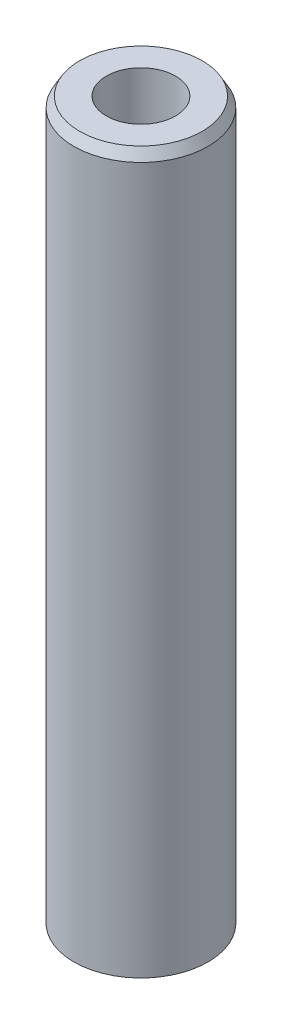
ISO-10303-21;
HEADER;
FILE_DESCRIPTION(('STEP AP214'),'2;1');
FILE_NAME('part.step','',(''),(''),'','','');
FILE_SCHEMA(('AUTOMOTIVE_DESIGN { 1 0 10303 214 1 1 1 1 }'));
ENDSEC;
DATA;
#1=APPLICATION_CONTEXT('core data for automotive mechanical design processes');
#2=APPLICATION_PROTOCOL_DEFINITION('international standard','automotive_design',2000,#1);
#3=PRODUCT_CONTEXT('',#1,'mechanical');
#4=PRODUCT('Part','Part','',(#3));
#5=PRODUCT_RELATED_PRODUCT_CATEGORY('part','',(#4));
#6=PRODUCT_DEFINITION_FORMATION('','',#4);
#7=PRODUCT_DEFINITION_CONTEXT('part definition',#1,'design');
#8=PRODUCT_DEFINITION('design','',#6,#7);
#9=PRODUCT_DEFINITION_SHAPE('','',#8);
#10=(LENGTH_UNIT() NAMED_UNIT(*) SI_UNIT(.MILLI.,.METRE.));
#11=(NAMED_UNIT(*) PLANE_ANGLE_UNIT() SI_UNIT($,.RADIAN.));
#12=(NAMED_UNIT(*) SI_UNIT($,.STERADIAN.) SOLID_ANGLE_UNIT());
#13=UNCERTAINTY_MEASURE_WITH_UNIT(LENGTH_MEASURE(1.E-05),#10,'distance_accuracy_value','');
#14=(GEOMETRIC_REPRESENTATION_CONTEXT(3) GLOBAL_UNCERTAINTY_ASSIGNED_CONTEXT((#13)) GLOBAL_UNIT_ASSIGNED_CONTEXT((#10,
#11,#12)) REPRESENTATION_CONTEXT('',''));
#15=CARTESIAN_POINT('',(0.,0.,0.));
#16=DIRECTION('',(0.,0.,1.));
#17=DIRECTION('',(1.,0.,0.));
#18=AXIS2_PLACEMENT_3D('',#15,#16,#17);
#19=CARTESIAN_POINT('',(0.,188.355232041194,0.));
#20=DIRECTION('',(0.,-1.,0.));
#21=DIRECTION('',(0.,0.,-1.));
#22=AXIS2_PLACEMENT_3D('',#19,#20,#21);
#23=CYLINDRICAL_SURFACE('',#22,17.5);
#24=CARTESIAN_POINT('',(0.,185.717655159102,0.));
#25=DIRECTION('',(0.,1.,0.));
#26=DIRECTION('',(0.,0.,1.));
#27=AXIS2_PLACEMENT_3D('',#24,#25,#26);
#28=CIRCLE('',#27,17.5);
#29=CARTESIAN_POINT('',(0.,185.717655159102,17.5));
#30=VERTEX_POINT('',#29);
#31=EDGE_CURVE('E50',#30,#30,#28,.F.);
#32=ORIENTED_EDGE('',*,*,#31,.T.);
#33=EDGE_LOOP('',(#32));
#34=FACE_BOUND('',#33,.T.);
#35=CARTESIAN_POINT('',(0.,1.52280572288413,0.));
#36=DIRECTION('',(0.,1.,0.));
#37=DIRECTION('',(0.,0.,1.));
#38=AXIS2_PLACEMENT_3D('',#35,#36,#37);
#39=CIRCLE('',#38,17.5);
#40=CARTESIAN_POINT('',(0.,1.52280572288413,17.5));
#41=VERTEX_POINT('',#40);
#42=EDGE_CURVE('E51',#41,#41,#39,.T.);
#43=ORIENTED_EDGE('',*,*,#42,.T.);
#44=EDGE_LOOP('',(#43));
#45=FACE_BOUND('',#44,.T.);
#46=ADVANCED_FACE('F39',(#34,#45),#23,.T.);
#47=CARTESIAN_POINT('',(0.,188.355232041194,0.));
#48=DIRECTION('',(0.,1.,0.));
#49=DIRECTION('',(0.,0.,1.));
#50=AXIS2_PLACEMENT_3D('',#47,#48,#49);
#51=PLANE('',#50);
#52=CARTESIAN_POINT('',(0.,188.355232041194,0.));
#53=DIRECTION('',(0.,1.,0.));
#54=DIRECTION('',(0.,0.,1.));
#55=AXIS2_PLACEMENT_3D('',#52,#53,#54);
#56=CIRCLE('',#55,15.9771942771158);
#57=CARTESIAN_POINT('',(0.,188.355232041194,15.9771942771158));
#58=VERTEX_POINT('',#57);
#59=EDGE_CURVE('E54',#58,#58,#56,.T.);
#60=ORIENTED_EDGE('',*,*,#59,.T.);
#61=EDGE_LOOP('',(#60));
#62=FACE_BOUND('',#61,.T.);
#63=CARTESIAN_POINT('',(0.,188.355232041194,0.));
#64=DIRECTION('',(0.,1.,0.));
#65=DIRECTION('',(0.,0.,1.));
#66=AXIS2_PLACEMENT_3D('',#63,#64,#65);
#67=CIRCLE('',#66,9.0276354067385);
#68=CARTESIAN_POINT('',(0.,188.355232041194,9.0276354067385));
#69=VERTEX_POINT('',#68);
#70=EDGE_CURVE('E58',#69,#69,#67,.T.);
#71=ORIENTED_EDGE('',*,*,#70,.F.);
#72=EDGE_LOOP('',(#71));
#73=FACE_BOUND('',#72,.T.);
#74=ADVANCED_FACE('F69',(#62,#73),#51,.T.);
#75=CARTESIAN_POINT('',(0.,0.,0.));
#76=DIRECTION('',(0.,1.,0.));
#77=DIRECTION('',(0.,0.,1.));
#78=AXIS2_PLACEMENT_3D('',#75,#76,#77);
#79=PLANE('',#78);
#80=CARTESIAN_POINT('',(0.,0.,0.));
#81=DIRECTION('',(0.,1.,0.));
#82=DIRECTION('',(0.,0.,1.));
#83=AXIS2_PLACEMENT_3D('',#80,#81,#82);
#84=CIRCLE('',#83,14.862423117908);
#85=CARTESIAN_POINT('',(0.,0.,14.862423117908));
#86=VERTEX_POINT('',#85);
#87=EDGE_CURVE('E10',#86,#86,#84,.F.);
#88=ORIENTED_EDGE('',*,*,#87,.T.);
#89=EDGE_LOOP('',(#88));
#90=FACE_BOUND('',#89,.T.);
#91=CARTESIAN_POINT('',(0.,0.,0.));
#92=DIRECTION('',(0.,1.,0.));
#93=DIRECTION('',(0.,0.,1.));
#94=AXIS2_PLACEMENT_3D('',#91,#92,#93);
#95=CIRCLE('',#94,9.0276354067385);
#96=CARTESIAN_POINT('',(0.,0.,9.0276354067385));
#97=VERTEX_POINT('',#96);
#98=EDGE_CURVE('E63',#97,#97,#95,.T.);
#99=ORIENTED_EDGE('',*,*,#98,.T.);
#100=EDGE_LOOP('',(#99));
#101=FACE_BOUND('',#100,.T.);
#102=ADVANCED_FACE('F75',(#90,#101),#79,.F.);
#103=CARTESIAN_POINT('',(0.,188.355232041194,0.));
#104=DIRECTION('',(0.,-1.,0.));
#105=DIRECTION('',(0.,0.,-1.));
#106=AXIS2_PLACEMENT_3D('',#103,#104,#105);
#107=CYLINDRICAL_SURFACE('',#106,9.0276354067385);
#108=ORIENTED_EDGE('',*,*,#70,.T.);
#109=EDGE_LOOP('',(#108));
#110=FACE_BOUND('',#109,.T.);
#111=ORIENTED_EDGE('',*,*,#98,.F.);
#112=EDGE_LOOP('',(#111));
#113=FACE_BOUND('',#112,.T.);
#114=ADVANCED_FACE('F70',(#110,#113),#107,.F.);
#115=CARTESIAN_POINT('',(0.,188.355232041194,0.));
#116=DIRECTION('',(0.,-1.,0.));
#117=DIRECTION('',(0.,0.,-1.));
#118=AXIS2_PLACEMENT_3D('',#115,#116,#117);
#119=CONICAL_SURFACE('',#118,15.9771942771158,0.523598775598295);
#120=ORIENTED_EDGE('',*,*,#31,.F.);
#121=EDGE_LOOP('',(#120));
#122=FACE_BOUND('',#121,.T.);
#123=ORIENTED_EDGE('',*,*,#59,.F.);
#124=EDGE_LOOP('',(#123));
#125=FACE_BOUND('',#124,.T.);
#126=ADVANCED_FACE('F81',(#122,#125),#119,.T.);
#127=CARTESIAN_POINT('',(0.,1.52280572288413,0.));
#128=DIRECTION('',(0.,1.,0.));
#129=DIRECTION('',(0.,0.,1.));
#130=AXIS2_PLACEMENT_3D('',#127,#128,#129);
#131=CONICAL_SURFACE('',#130,17.5,1.0471975511966);
#132=ORIENTED_EDGE('',*,*,#87,.F.);
#133=EDGE_LOOP('',(#132));
#134=FACE_BOUND('',#133,.T.);
#135=ORIENTED_EDGE('',*,*,#42,.F.);
#136=EDGE_LOOP('',(#135));
#137=FACE_BOUND('',#136,.T.);
#138=ADVANCED_FACE('F45',(#134,#137),#131,.T.);
#139=CLOSED_SHELL('',(#46,#74,#102,#114,#126,#138));
#140=MANIFOLD_SOLID_BREP('B2',#139);
#141=ADVANCED_BREP_SHAPE_REPRESENTATION('',(#18,#140),#14);
#142=SHAPE_DEFINITION_REPRESENTATION(#9,#141);
ENDSEC;
END-ISO-10303-21;
